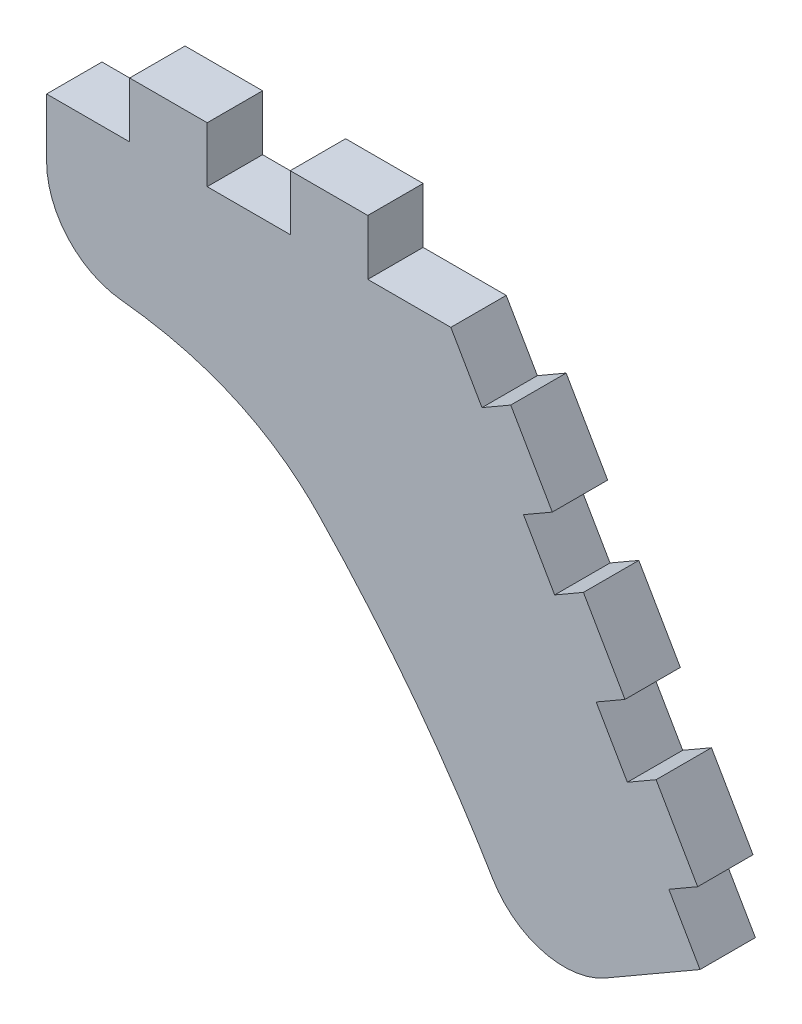
ISO-10303-21;
HEADER;
FILE_DESCRIPTION(('STEP AP214'),'2;1');
FILE_NAME('part.step','',(''),(''),'','','');
FILE_SCHEMA(('AUTOMOTIVE_DESIGN { 1 0 10303 214 1 1 1 1 }'));
ENDSEC;
DATA;
#1=APPLICATION_CONTEXT('core data for automotive mechanical design processes');
#2=APPLICATION_PROTOCOL_DEFINITION('international standard','automotive_design',2000,#1);
#3=PRODUCT_CONTEXT('',#1,'mechanical');
#4=PRODUCT('Part','Part','',(#3));
#5=PRODUCT_RELATED_PRODUCT_CATEGORY('part','',(#4));
#6=PRODUCT_DEFINITION_FORMATION('','',#4);
#7=PRODUCT_DEFINITION_CONTEXT('part definition',#1,'design');
#8=PRODUCT_DEFINITION('design','',#6,#7);
#9=PRODUCT_DEFINITION_SHAPE('','',#8);
#10=(LENGTH_UNIT() NAMED_UNIT(*) SI_UNIT(.MILLI.,.METRE.));
#11=(NAMED_UNIT(*) PLANE_ANGLE_UNIT() SI_UNIT($,.RADIAN.));
#12=(NAMED_UNIT(*) SI_UNIT($,.STERADIAN.) SOLID_ANGLE_UNIT());
#13=UNCERTAINTY_MEASURE_WITH_UNIT(LENGTH_MEASURE(1.E-05),#10,'distance_accuracy_value','');
#14=(GEOMETRIC_REPRESENTATION_CONTEXT(3) GLOBAL_UNCERTAINTY_ASSIGNED_CONTEXT((#13)) GLOBAL_UNIT_ASSIGNED_CONTEXT((#10,
#11,#12)) REPRESENTATION_CONTEXT('',''));
#15=CARTESIAN_POINT('',(0.,0.,0.));
#16=DIRECTION('',(0.,0.,1.));
#17=DIRECTION('',(1.,0.,0.));
#18=AXIS2_PLACEMENT_3D('',#15,#16,#17);
#19=CARTESIAN_POINT('',(0.,0.,10.));
#20=DIRECTION('',(1.,0.,0.));
#21=DIRECTION('',(0.,1.,0.));
#22=AXIS2_PLACEMENT_3D('',#19,#20,#21);
#23=PLANE('',#22);
#24=DIRECTION('',(0.,-1.,0.));
#25=VECTOR('',#24,1.);
#26=CARTESIAN_POINT('',(0.,0.,0.));
#27=LINE('',#26,#25);
#28=CARTESIAN_POINT('',(0.,0.,0.));
#29=VERTEX_POINT('',#28);
#30=CARTESIAN_POINT('',(0.,-10.5712182716982,0.));
#31=VERTEX_POINT('',#30);
#32=EDGE_CURVE('E413',#29,#31,#27,.T.);
#33=ORIENTED_EDGE('',*,*,#32,.T.);
#34=DIRECTION('',(0.,0.,-1.));
#35=VECTOR('',#34,1.);
#36=CARTESIAN_POINT('',(0.,-10.5712182716982,10.));
#37=LINE('',#36,#35);
#38=CARTESIAN_POINT('',(0.,-10.5712182716982,10.));
#39=VERTEX_POINT('',#38);
#40=EDGE_CURVE('E11',#31,#39,#37,.F.);
#41=ORIENTED_EDGE('',*,*,#40,.T.);
#42=DIRECTION('',(0.,-1.,0.));
#43=VECTOR('',#42,1.);
#44=CARTESIAN_POINT('',(0.,0.,10.));
#45=LINE('',#44,#43);
#46=CARTESIAN_POINT('',(0.,0.,10.));
#47=VERTEX_POINT('',#46);
#48=EDGE_CURVE('E224',#47,#39,#45,.T.);
#49=ORIENTED_EDGE('',*,*,#48,.F.);
#50=DIRECTION('',(0.,0.,-1.));
#51=VECTOR('',#50,1.);
#52=CARTESIAN_POINT('',(0.,0.,10.));
#53=LINE('',#52,#51);
#54=EDGE_CURVE('E353',#47,#29,#53,.T.);
#55=ORIENTED_EDGE('',*,*,#54,.T.);
#56=EDGE_LOOP('',(#33,#41,#49,#55));
#57=FACE_BOUND('',#56,.T.);
#58=ADVANCED_FACE('F32',(#57),#23,.F.);
#59=CARTESIAN_POINT('',(0.,-25.,10.));
#60=CARTESIAN_POINT('',(17.2425344672211,-24.6395737065002,10.));
#61=CARTESIAN_POINT('',(35.8999875961201,-27.5043263394054,10.));
#62=CARTESIAN_POINT('',(49.1604769860692,-41.2912650883352,10.));
#63=B_SPLINE_CURVE_WITH_KNOTS('',3,(#59,#60,#61,#62),.UNSPECIFIED.,.F.,.F.,(4,4),(0.,1.),.UNSPECIFIED.);
#64=DIRECTION('',(0.,0.,-1.));
#65=VECTOR('',#64,1.);
#66=SURFACE_OF_LINEAR_EXTRUSION('',#63,#65);
#67=CARTESIAN_POINT('',(13.4616697727823,-25.4921277651584,10.));
#68=VERTEX_POINT('',#67);
#69=CARTESIAN_POINT('',(49.1604769860692,-41.2912650883352,10.));
#70=VERTEX_POINT('',#69);
#71=EDGE_CURVE('E215',#68,#70,#63,.T.);
#72=ORIENTED_EDGE('',*,*,#71,.F.);
#73=DIRECTION('',(0.,0.,-1.));
#74=VECTOR('',#73,1.);
#75=CARTESIAN_POINT('',(13.4616697727821,-25.4921277651583,10.));
#76=LINE('',#75,#74);
#77=CARTESIAN_POINT('',(13.4616697727823,-25.4921277651584,0.));
#78=VERTEX_POINT('',#77);
#79=EDGE_CURVE('E40',#68,#78,#76,.T.);
#80=ORIENTED_EDGE('',*,*,#79,.T.);
#81=CARTESIAN_POINT('',(0.,-25.,0.));
#82=CARTESIAN_POINT('',(17.2425344672211,-24.6395737065002,0.));
#83=CARTESIAN_POINT('',(35.8999875961201,-27.5043263394054,0.));
#84=CARTESIAN_POINT('',(49.1604769860692,-41.2912650883352,0.));
#85=B_SPLINE_CURVE_WITH_KNOTS('',3,(#81,#82,#83,#84),.UNSPECIFIED.,.F.,.F.,(4,4),(0.,1.),.UNSPECIFIED.);
#86=CARTESIAN_POINT('',(49.1604769860692,-41.2912650883352,0.));
#87=VERTEX_POINT('',#86);
#88=EDGE_CURVE('E230',#78,#87,#85,.T.);
#89=ORIENTED_EDGE('',*,*,#88,.T.);
#90=DIRECTION('',(0.,0.,-1.));
#91=VECTOR('',#90,1.);
#92=CARTESIAN_POINT('',(49.1604769860692,-41.2912650883352,10.));
#93=LINE('',#92,#91);
#94=EDGE_CURVE('E227',#70,#87,#93,.T.);
#95=ORIENTED_EDGE('',*,*,#94,.F.);
#96=EDGE_LOOP('',(#72,#80,#89,#95));
#97=FACE_BOUND('',#96,.T.);
#98=ADVANCED_FACE('F228',(#97),#66,.F.);
#99=CARTESIAN_POINT('',(49.1604769860692,-41.2912650883352,10.));
#100=CARTESIAN_POINT('',(64.8173033808277,-57.5696768542521,10.));
#101=CARTESIAN_POINT('',(77.6601813413194,-75.6200172716735,10.));
#102=CARTESIAN_POINT('',(87.6891108675445,-95.4422863405995,10.));
#103=B_SPLINE_CURVE_WITH_KNOTS('',3,(#99,#100,#101,#102),.UNSPECIFIED.,.F.,.F.,(4,4),(0.,1.),.UNSPECIFIED.);
#104=DIRECTION('',(0.,0.,-1.));
#105=VECTOR('',#104,1.);
#106=SURFACE_OF_LINEAR_EXTRUSION('',#103,#105);
#107=CARTESIAN_POINT('',(49.1604769860692,-41.2912650883352,0.));
#108=CARTESIAN_POINT('',(64.8173033808277,-57.5696768542521,0.));
#109=CARTESIAN_POINT('',(77.6601813413194,-75.6200172716735,0.));
#110=CARTESIAN_POINT('',(87.6891108675445,-95.4422863405995,0.));
#111=B_SPLINE_CURVE_WITH_KNOTS('',3,(#107,#108,#109,#110),.UNSPECIFIED.,.F.,.F.,(4,4),(0.,1.),.UNSPECIFIED.);
#112=CARTESIAN_POINT('',(80.5569815722585,-82.440526329078,0.));
#113=VERTEX_POINT('',#112);
#114=EDGE_CURVE('E403',#87,#113,#111,.T.);
#115=ORIENTED_EDGE('',*,*,#114,.T.);
#116=DIRECTION('',(0.,0.,-1.));
#117=VECTOR('',#116,1.);
#118=CARTESIAN_POINT('',(80.5569815722585,-82.440526329078,0.));
#119=LINE('',#118,#117);
#120=CARTESIAN_POINT('',(80.5569815722585,-82.440526329078,10.));
#121=VERTEX_POINT('',#120);
#122=EDGE_CURVE('E239',#113,#121,#119,.F.);
#123=ORIENTED_EDGE('',*,*,#122,.T.);
#124=EDGE_CURVE('E219',#70,#121,#103,.T.);
#125=ORIENTED_EDGE('',*,*,#124,.F.);
#126=ORIENTED_EDGE('',*,*,#94,.T.);
#127=EDGE_LOOP('',(#115,#123,#125,#126));
#128=FACE_BOUND('',#127,.T.);
#129=ADVANCED_FACE('F237',(#128),#106,.F.);
#130=CARTESIAN_POINT('',(118.,-77.9422863405996,10.));
#131=DIRECTION('',(-0.499999999999999,0.866025403784439,0.));
#132=DIRECTION('',(-0.866025403784439,-0.499999999999999,0.));
#133=AXIS2_PLACEMENT_3D('',#130,#131,#132);
#134=PLANE('',#133);
#135=DIRECTION('',(0.866025403784439,0.499999999999999,0.));
#136=VECTOR('',#135,1.);
#137=CARTESIAN_POINT('',(118.,-77.9422863405996,10.));
#138=LINE('',#137,#136);
#139=CARTESIAN_POINT('',(100.959447349708,-87.7806540003853,10.));
#140=VERTEX_POINT('',#139);
#141=CARTESIAN_POINT('',(118.,-77.9422863405996,10.));
#142=VERTEX_POINT('',#141);
#143=EDGE_CURVE('E240',#140,#142,#138,.T.);
#144=ORIENTED_EDGE('',*,*,#143,.F.);
#145=DIRECTION('',(0.,0.,-1.));
#146=VECTOR('',#145,1.);
#147=CARTESIAN_POINT('',(100.959447349708,-87.7806540003853,10.));
#148=LINE('',#147,#146);
#149=CARTESIAN_POINT('',(100.959447349708,-87.7806540003853,0.));
#150=VERTEX_POINT('',#149);
#151=EDGE_CURVE('E234',#140,#150,#148,.T.);
#152=ORIENTED_EDGE('',*,*,#151,.T.);
#153=DIRECTION('',(0.866025403784439,0.499999999999999,0.));
#154=VECTOR('',#153,1.);
#155=CARTESIAN_POINT('',(118.,-77.9422863405996,0.));
#156=LINE('',#155,#154);
#157=CARTESIAN_POINT('',(118.,-77.9422863405996,0.));
#158=VERTEX_POINT('',#157);
#159=EDGE_CURVE('E401',#150,#158,#156,.T.);
#160=ORIENTED_EDGE('',*,*,#159,.T.);
#161=DIRECTION('',(0.,0.,-1.));
#162=VECTOR('',#161,1.);
#163=CARTESIAN_POINT('',(118.,-77.9422863405996,10.));
#164=LINE('',#163,#162);
#165=EDGE_CURVE('E235',#142,#158,#164,.T.);
#166=ORIENTED_EDGE('',*,*,#165,.F.);
#167=EDGE_LOOP('',(#144,#152,#160,#166));
#168=FACE_BOUND('',#167,.T.);
#169=ADVANCED_FACE('F259',(#168),#134,.F.);
#170=CARTESIAN_POINT('',(112.375,-68.1995005480246,10.));
#171=DIRECTION('',(-0.86602540378444,-0.499999999999998,0.));
#172=DIRECTION('',(0.499999999999998,-0.86602540378444,0.));
#173=AXIS2_PLACEMENT_3D('',#170,#171,#172);
#174=PLANE('',#173);
#175=DIRECTION('',(-0.499999999999998,0.86602540378444,0.));
#176=VECTOR('',#175,1.);
#177=CARTESIAN_POINT('',(112.375,-68.1995005480246,0.));
#178=LINE('',#177,#176);
#179=CARTESIAN_POINT('',(112.375,-68.1995005480246,0.));
#180=VERTEX_POINT('',#179);
#181=EDGE_CURVE('E399',#158,#180,#178,.T.);
#182=ORIENTED_EDGE('',*,*,#181,.T.);
#183=DIRECTION('',(0.,0.,-1.));
#184=VECTOR('',#183,1.);
#185=CARTESIAN_POINT('',(112.375,-68.1995005480246,10.));
#186=LINE('',#185,#184);
#187=CARTESIAN_POINT('',(112.375,-68.1995005480246,10.));
#188=VERTEX_POINT('',#187);
#189=EDGE_CURVE('E290',#188,#180,#186,.T.);
#190=ORIENTED_EDGE('',*,*,#189,.F.);
#191=DIRECTION('',(-0.499999999999998,0.86602540378444,0.));
#192=VECTOR('',#191,1.);
#193=CARTESIAN_POINT('',(112.375,-68.1995005480246,10.));
#194=LINE('',#193,#192);
#195=EDGE_CURVE('E242',#142,#188,#194,.T.);
#196=ORIENTED_EDGE('',*,*,#195,.F.);
#197=ORIENTED_EDGE('',*,*,#165,.T.);
#198=EDGE_LOOP('',(#182,#190,#196,#197));
#199=FACE_BOUND('',#198,.T.);
#200=ADVANCED_FACE('F464',(#199),#174,.F.);
#201=CARTESIAN_POINT('',(117.571152422706,-65.1995005480249,10.));
#202=DIRECTION('',(-0.499999999999999,0.866025403784439,0.));
#203=DIRECTION('',(-0.86602540378444,-0.499999999999999,0.));
#204=AXIS2_PLACEMENT_3D('',#201,#202,#203);
#205=PLANE('',#204);
#206=DIRECTION('',(0.866025403784439,0.499999999999999,0.));
#207=VECTOR('',#206,1.);
#208=CARTESIAN_POINT('',(117.571152422706,-65.1995005480249,0.));
#209=LINE('',#208,#207);
#210=CARTESIAN_POINT('',(117.571152422706,-65.1995005480249,0.));
#211=VERTEX_POINT('',#210);
#212=EDGE_CURVE('E397',#180,#211,#209,.T.);
#213=ORIENTED_EDGE('',*,*,#212,.T.);
#214=DIRECTION('',(0.,0.,-1.));
#215=VECTOR('',#214,1.);
#216=CARTESIAN_POINT('',(117.571152422706,-65.1995005480249,10.));
#217=LINE('',#216,#215);
#218=CARTESIAN_POINT('',(117.571152422706,-65.1995005480249,10.));
#219=VERTEX_POINT('',#218);
#220=EDGE_CURVE('E293',#219,#211,#217,.T.);
#221=ORIENTED_EDGE('',*,*,#220,.F.);
#222=DIRECTION('',(0.866025403784439,0.499999999999999,0.));
#223=VECTOR('',#222,1.);
#224=CARTESIAN_POINT('',(117.571152422706,-65.1995005480249,10.));
#225=LINE('',#224,#223);
#226=EDGE_CURVE('E457',#188,#219,#225,.T.);
#227=ORIENTED_EDGE('',*,*,#226,.F.);
#228=ORIENTED_EDGE('',*,*,#189,.T.);
#229=EDGE_LOOP('',(#213,#221,#227,#228));
#230=FACE_BOUND('',#229,.T.);
#231=ADVANCED_FACE('F468',(#230),#205,.F.);
#232=CARTESIAN_POINT('',(110.071152422706,-52.2091194912583,10.));
#233=DIRECTION('',(-0.866025403784439,-0.5,0.));
#234=DIRECTION('',(0.5,-0.866025403784439,0.));
#235=AXIS2_PLACEMENT_3D('',#232,#233,#234);
#236=PLANE('',#235);
#237=DIRECTION('',(-0.5,0.866025403784439,0.));
#238=VECTOR('',#237,1.);
#239=CARTESIAN_POINT('',(110.071152422706,-52.2091194912583,0.));
#240=LINE('',#239,#238);
#241=CARTESIAN_POINT('',(110.071152422706,-52.2091194912583,0.));
#242=VERTEX_POINT('',#241);
#243=EDGE_CURVE('E395',#211,#242,#240,.T.);
#244=ORIENTED_EDGE('',*,*,#243,.T.);
#245=DIRECTION('',(0.,0.,-1.));
#246=VECTOR('',#245,1.);
#247=CARTESIAN_POINT('',(110.071152422706,-52.2091194912583,10.));
#248=LINE('',#247,#246);
#249=CARTESIAN_POINT('',(110.071152422706,-52.2091194912583,10.));
#250=VERTEX_POINT('',#249);
#251=EDGE_CURVE('E296',#250,#242,#248,.T.);
#252=ORIENTED_EDGE('',*,*,#251,.F.);
#253=DIRECTION('',(-0.5,0.866025403784439,0.));
#254=VECTOR('',#253,1.);
#255=CARTESIAN_POINT('',(110.071152422706,-52.2091194912583,10.));
#256=LINE('',#255,#254);
#257=EDGE_CURVE('E455',#219,#250,#256,.T.);
#258=ORIENTED_EDGE('',*,*,#257,.F.);
#259=ORIENTED_EDGE('',*,*,#220,.T.);
#260=EDGE_LOOP('',(#244,#252,#258,#259));
#261=FACE_BOUND('',#260,.T.);
#262=ADVANCED_FACE('F473',(#261),#236,.F.);
#263=CARTESIAN_POINT('',(104.875,-55.209119491258,10.));
#264=DIRECTION('',(0.499999999999999,-0.866025403784439,0.));
#265=DIRECTION('',(0.866025403784439,0.499999999999999,0.));
#266=AXIS2_PLACEMENT_3D('',#263,#264,#265);
#267=PLANE('',#266);
#268=DIRECTION('',(-0.866025403784439,-0.499999999999999,0.));
#269=VECTOR('',#268,1.);
#270=CARTESIAN_POINT('',(104.875,-55.209119491258,0.));
#271=LINE('',#270,#269);
#272=CARTESIAN_POINT('',(104.875,-55.209119491258,0.));
#273=VERTEX_POINT('',#272);
#274=EDGE_CURVE('E393',#242,#273,#271,.T.);
#275=ORIENTED_EDGE('',*,*,#274,.T.);
#276=DIRECTION('',(0.,0.,-1.));
#277=VECTOR('',#276,1.);
#278=CARTESIAN_POINT('',(104.875,-55.209119491258,10.));
#279=LINE('',#278,#277);
#280=CARTESIAN_POINT('',(104.875,-55.209119491258,10.));
#281=VERTEX_POINT('',#280);
#282=EDGE_CURVE('E299',#281,#273,#279,.T.);
#283=ORIENTED_EDGE('',*,*,#282,.F.);
#284=DIRECTION('',(-0.866025403784439,-0.499999999999999,0.));
#285=VECTOR('',#284,1.);
#286=CARTESIAN_POINT('',(104.875,-55.209119491258,10.));
#287=LINE('',#286,#285);
#288=EDGE_CURVE('E453',#250,#281,#287,.T.);
#289=ORIENTED_EDGE('',*,*,#288,.F.);
#290=ORIENTED_EDGE('',*,*,#251,.T.);
#291=EDGE_LOOP('',(#275,#283,#289,#290));
#292=FACE_BOUND('',#291,.T.);
#293=ADVANCED_FACE('F479',(#292),#267,.F.);
#294=CARTESIAN_POINT('',(99.2499999999999,-45.4663336986831,10.));
#295=DIRECTION('',(-0.866025403784439,-0.499999999999999,0.));
#296=DIRECTION('',(0.499999999999999,-0.866025403784439,0.));
#297=AXIS2_PLACEMENT_3D('',#294,#295,#296);
#298=PLANE('',#297);
#299=DIRECTION('',(-0.499999999999999,0.866025403784439,0.));
#300=VECTOR('',#299,1.);
#301=CARTESIAN_POINT('',(99.2499999999999,-45.4663336986831,0.));
#302=LINE('',#301,#300);
#303=CARTESIAN_POINT('',(99.2499999999999,-45.4663336986831,0.));
#304=VERTEX_POINT('',#303);
#305=EDGE_CURVE('E391',#273,#304,#302,.T.);
#306=ORIENTED_EDGE('',*,*,#305,.T.);
#307=DIRECTION('',(0.,0.,-1.));
#308=VECTOR('',#307,1.);
#309=CARTESIAN_POINT('',(99.2499999999999,-45.4663336986831,10.));
#310=LINE('',#309,#308);
#311=CARTESIAN_POINT('',(99.2499999999999,-45.4663336986831,10.));
#312=VERTEX_POINT('',#311);
#313=EDGE_CURVE('E302',#312,#304,#310,.T.);
#314=ORIENTED_EDGE('',*,*,#313,.F.);
#315=DIRECTION('',(-0.499999999999999,0.866025403784439,0.));
#316=VECTOR('',#315,1.);
#317=CARTESIAN_POINT('',(99.2499999999999,-45.4663336986831,10.));
#318=LINE('',#317,#316);
#319=EDGE_CURVE('E451',#281,#312,#318,.T.);
#320=ORIENTED_EDGE('',*,*,#319,.F.);
#321=ORIENTED_EDGE('',*,*,#282,.T.);
#322=EDGE_LOOP('',(#306,#314,#320,#321));
#323=FACE_BOUND('',#322,.T.);
#324=ADVANCED_FACE('F483',(#323),#298,.F.);
#325=CARTESIAN_POINT('',(104.446152422706,-42.4663336986834,10.));
#326=DIRECTION('',(-0.499999999999998,0.86602540378444,0.));
#327=DIRECTION('',(-0.86602540378444,-0.499999999999998,0.));
#328=AXIS2_PLACEMENT_3D('',#325,#326,#327);
#329=PLANE('',#328);
#330=DIRECTION('',(0.86602540378444,0.499999999999998,0.));
#331=VECTOR('',#330,1.);
#332=CARTESIAN_POINT('',(104.446152422706,-42.4663336986834,0.));
#333=LINE('',#332,#331);
#334=CARTESIAN_POINT('',(104.446152422706,-42.4663336986834,0.));
#335=VERTEX_POINT('',#334);
#336=EDGE_CURVE('E389',#304,#335,#333,.T.);
#337=ORIENTED_EDGE('',*,*,#336,.T.);
#338=DIRECTION('',(0.,0.,-1.));
#339=VECTOR('',#338,1.);
#340=CARTESIAN_POINT('',(104.446152422706,-42.4663336986834,10.));
#341=LINE('',#340,#339);
#342=CARTESIAN_POINT('',(104.446152422706,-42.4663336986834,10.));
#343=VERTEX_POINT('',#342);
#344=EDGE_CURVE('E305',#343,#335,#341,.T.);
#345=ORIENTED_EDGE('',*,*,#344,.F.);
#346=DIRECTION('',(0.86602540378444,0.499999999999998,0.));
#347=VECTOR('',#346,1.);
#348=CARTESIAN_POINT('',(104.446152422706,-42.4663336986834,10.));
#349=LINE('',#348,#347);
#350=EDGE_CURVE('E449',#312,#343,#349,.T.);
#351=ORIENTED_EDGE('',*,*,#350,.F.);
#352=ORIENTED_EDGE('',*,*,#313,.T.);
#353=EDGE_LOOP('',(#337,#345,#351,#352));
#354=FACE_BOUND('',#353,.T.);
#355=ADVANCED_FACE('F488',(#354),#329,.F.);
#356=CARTESIAN_POINT('',(96.946152422706,-29.4759526419168,10.));
#357=DIRECTION('',(-0.866025403784439,-0.5,0.));
#358=DIRECTION('',(0.5,-0.866025403784439,0.));
#359=AXIS2_PLACEMENT_3D('',#356,#357,#358);
#360=PLANE('',#359);
#361=DIRECTION('',(-0.5,0.866025403784439,0.));
#362=VECTOR('',#361,1.);
#363=CARTESIAN_POINT('',(96.946152422706,-29.4759526419168,0.));
#364=LINE('',#363,#362);
#365=CARTESIAN_POINT('',(96.946152422706,-29.4759526419168,0.));
#366=VERTEX_POINT('',#365);
#367=EDGE_CURVE('E387',#335,#366,#364,.T.);
#368=ORIENTED_EDGE('',*,*,#367,.T.);
#369=DIRECTION('',(0.,0.,-1.));
#370=VECTOR('',#369,1.);
#371=CARTESIAN_POINT('',(96.946152422706,-29.4759526419168,10.));
#372=LINE('',#371,#370);
#373=CARTESIAN_POINT('',(96.946152422706,-29.4759526419168,10.));
#374=VERTEX_POINT('',#373);
#375=EDGE_CURVE('E308',#374,#366,#372,.T.);
#376=ORIENTED_EDGE('',*,*,#375,.F.);
#377=DIRECTION('',(-0.5,0.866025403784439,0.));
#378=VECTOR('',#377,1.);
#379=CARTESIAN_POINT('',(96.946152422706,-29.4759526419168,10.));
#380=LINE('',#379,#378);
#381=EDGE_CURVE('E447',#343,#374,#380,.T.);
#382=ORIENTED_EDGE('',*,*,#381,.F.);
#383=ORIENTED_EDGE('',*,*,#344,.T.);
#384=EDGE_LOOP('',(#368,#376,#382,#383));
#385=FACE_BOUND('',#384,.T.);
#386=ADVANCED_FACE('F494',(#385),#360,.F.);
#387=CARTESIAN_POINT('',(91.7499999999999,-32.4759526419165,10.));
#388=DIRECTION('',(0.499999999999998,-0.866025403784439,0.));
#389=DIRECTION('',(0.86602540378444,0.499999999999998,0.));
#390=AXIS2_PLACEMENT_3D('',#387,#388,#389);
#391=PLANE('',#390);
#392=DIRECTION('',(-0.866025403784439,-0.499999999999998,0.));
#393=VECTOR('',#392,1.);
#394=CARTESIAN_POINT('',(91.7499999999999,-32.4759526419165,0.));
#395=LINE('',#394,#393);
#396=CARTESIAN_POINT('',(91.7499999999999,-32.4759526419165,0.));
#397=VERTEX_POINT('',#396);
#398=EDGE_CURVE('E385',#366,#397,#395,.T.);
#399=ORIENTED_EDGE('',*,*,#398,.T.);
#400=DIRECTION('',(0.,0.,-1.));
#401=VECTOR('',#400,1.);
#402=CARTESIAN_POINT('',(91.7499999999999,-32.4759526419165,10.));
#403=LINE('',#402,#401);
#404=CARTESIAN_POINT('',(91.7499999999999,-32.4759526419165,10.));
#405=VERTEX_POINT('',#404);
#406=EDGE_CURVE('E311',#405,#397,#403,.T.);
#407=ORIENTED_EDGE('',*,*,#406,.F.);
#408=DIRECTION('',(-0.866025403784439,-0.499999999999998,0.));
#409=VECTOR('',#408,1.);
#410=CARTESIAN_POINT('',(91.7499999999999,-32.4759526419165,10.));
#411=LINE('',#410,#409);
#412=EDGE_CURVE('E445',#374,#405,#411,.T.);
#413=ORIENTED_EDGE('',*,*,#412,.F.);
#414=ORIENTED_EDGE('',*,*,#375,.T.);
#415=EDGE_LOOP('',(#399,#407,#413,#414));
#416=FACE_BOUND('',#415,.T.);
#417=ADVANCED_FACE('F498',(#416),#391,.F.);
#418=CARTESIAN_POINT('',(86.125,-22.7331668493415,10.));
#419=DIRECTION('',(-0.866025403784439,-0.5,0.));
#420=DIRECTION('',(0.5,-0.866025403784439,0.));
#421=AXIS2_PLACEMENT_3D('',#418,#419,#420);
#422=PLANE('',#421);
#423=DIRECTION('',(-0.499999999999999,0.866025403784439,0.));
#424=VECTOR('',#423,1.);
#425=CARTESIAN_POINT('',(86.125,-22.7331668493415,0.));
#426=LINE('',#425,#424);
#427=CARTESIAN_POINT('',(86.125,-22.7331668493415,0.));
#428=VERTEX_POINT('',#427);
#429=EDGE_CURVE('E383',#397,#428,#426,.T.);
#430=ORIENTED_EDGE('',*,*,#429,.T.);
#431=DIRECTION('',(0.,0.,-1.));
#432=VECTOR('',#431,1.);
#433=CARTESIAN_POINT('',(86.125,-22.7331668493415,10.));
#434=LINE('',#433,#432);
#435=CARTESIAN_POINT('',(86.125,-22.7331668493415,10.));
#436=VERTEX_POINT('',#435);
#437=EDGE_CURVE('E314',#436,#428,#434,.T.);
#438=ORIENTED_EDGE('',*,*,#437,.F.);
#439=DIRECTION('',(-0.499999999999999,0.866025403784439,0.));
#440=VECTOR('',#439,1.);
#441=CARTESIAN_POINT('',(86.125,-22.7331668493415,10.));
#442=LINE('',#441,#440);
#443=EDGE_CURVE('E443',#405,#436,#442,.T.);
#444=ORIENTED_EDGE('',*,*,#443,.F.);
#445=ORIENTED_EDGE('',*,*,#406,.T.);
#446=EDGE_LOOP('',(#430,#438,#444,#445));
#447=FACE_BOUND('',#446,.T.);
#448=ADVANCED_FACE('F503',(#447),#422,.F.);
#449=CARTESIAN_POINT('',(91.321152422706,-19.7331668493419,10.));
#450=DIRECTION('',(-0.5,0.866025403784439,0.));
#451=DIRECTION('',(-0.866025403784439,-0.5,0.));
#452=AXIS2_PLACEMENT_3D('',#449,#450,#451);
#453=PLANE('',#452);
#454=DIRECTION('',(0.866025403784439,0.5,0.));
#455=VECTOR('',#454,1.);
#456=CARTESIAN_POINT('',(91.321152422706,-19.7331668493419,0.));
#457=LINE('',#456,#455);
#458=CARTESIAN_POINT('',(91.321152422706,-19.7331668493419,0.));
#459=VERTEX_POINT('',#458);
#460=EDGE_CURVE('E381',#428,#459,#457,.T.);
#461=ORIENTED_EDGE('',*,*,#460,.T.);
#462=DIRECTION('',(0.,0.,-1.));
#463=VECTOR('',#462,1.);
#464=CARTESIAN_POINT('',(91.321152422706,-19.7331668493419,10.));
#465=LINE('',#464,#463);
#466=CARTESIAN_POINT('',(91.321152422706,-19.7331668493419,10.));
#467=VERTEX_POINT('',#466);
#468=EDGE_CURVE('E317',#467,#459,#465,.T.);
#469=ORIENTED_EDGE('',*,*,#468,.F.);
#470=DIRECTION('',(0.866025403784439,0.5,0.));
#471=VECTOR('',#470,1.);
#472=CARTESIAN_POINT('',(91.321152422706,-19.7331668493419,10.));
#473=LINE('',#472,#471);
#474=EDGE_CURVE('E441',#436,#467,#473,.T.);
#475=ORIENTED_EDGE('',*,*,#474,.F.);
#476=ORIENTED_EDGE('',*,*,#437,.T.);
#477=EDGE_LOOP('',(#461,#469,#475,#476));
#478=FACE_BOUND('',#477,.T.);
#479=ADVANCED_FACE('F509',(#478),#453,.F.);
#480=CARTESIAN_POINT('',(83.821152422706,-6.74278579257528,10.));
#481=DIRECTION('',(-0.86602540378444,-0.499999999999998,0.));
#482=DIRECTION('',(0.499999999999998,-0.86602540378444,0.));
#483=AXIS2_PLACEMENT_3D('',#480,#481,#482);
#484=PLANE('',#483);
#485=DIRECTION('',(-0.499999999999998,0.86602540378444,0.));
#486=VECTOR('',#485,1.);
#487=CARTESIAN_POINT('',(83.821152422706,-6.74278579257528,0.));
#488=LINE('',#487,#486);
#489=CARTESIAN_POINT('',(83.821152422706,-6.74278579257528,0.));
#490=VERTEX_POINT('',#489);
#491=EDGE_CURVE('E379',#459,#490,#488,.T.);
#492=ORIENTED_EDGE('',*,*,#491,.T.);
#493=DIRECTION('',(0.,0.,-1.));
#494=VECTOR('',#493,1.);
#495=CARTESIAN_POINT('',(83.821152422706,-6.74278579257528,10.));
#496=LINE('',#495,#494);
#497=CARTESIAN_POINT('',(83.821152422706,-6.74278579257528,10.));
#498=VERTEX_POINT('',#497);
#499=EDGE_CURVE('E320',#498,#490,#496,.T.);
#500=ORIENTED_EDGE('',*,*,#499,.F.);
#501=DIRECTION('',(-0.499999999999998,0.86602540378444,0.));
#502=VECTOR('',#501,1.);
#503=CARTESIAN_POINT('',(83.821152422706,-6.74278579257528,10.));
#504=LINE('',#503,#502);
#505=EDGE_CURVE('E439',#467,#498,#504,.T.);
#506=ORIENTED_EDGE('',*,*,#505,.F.);
#507=ORIENTED_EDGE('',*,*,#468,.T.);
#508=EDGE_LOOP('',(#492,#500,#506,#507));
#509=FACE_BOUND('',#508,.T.);
#510=ADVANCED_FACE('F513',(#509),#484,.F.);
#511=CARTESIAN_POINT('',(78.625,-9.74278579257494,10.));
#512=DIRECTION('',(0.499999999999999,-0.866025403784439,0.));
#513=DIRECTION('',(0.866025403784439,0.499999999999999,0.));
#514=AXIS2_PLACEMENT_3D('',#511,#512,#513);
#515=PLANE('',#514);
#516=DIRECTION('',(-0.866025403784439,-0.499999999999999,0.));
#517=VECTOR('',#516,1.);
#518=CARTESIAN_POINT('',(78.625,-9.74278579257494,0.));
#519=LINE('',#518,#517);
#520=CARTESIAN_POINT('',(78.625,-9.74278579257494,0.));
#521=VERTEX_POINT('',#520);
#522=EDGE_CURVE('E377',#490,#521,#519,.T.);
#523=ORIENTED_EDGE('',*,*,#522,.T.);
#524=DIRECTION('',(0.,0.,-1.));
#525=VECTOR('',#524,1.);
#526=CARTESIAN_POINT('',(78.625,-9.74278579257494,10.));
#527=LINE('',#526,#525);
#528=CARTESIAN_POINT('',(78.625,-9.74278579257494,10.));
#529=VERTEX_POINT('',#528);
#530=EDGE_CURVE('E323',#529,#521,#527,.T.);
#531=ORIENTED_EDGE('',*,*,#530,.F.);
#532=DIRECTION('',(-0.866025403784439,-0.499999999999999,0.));
#533=VECTOR('',#532,1.);
#534=CARTESIAN_POINT('',(78.625,-9.74278579257494,10.));
#535=LINE('',#534,#533);
#536=EDGE_CURVE('E437',#498,#529,#535,.T.);
#537=ORIENTED_EDGE('',*,*,#536,.F.);
#538=ORIENTED_EDGE('',*,*,#499,.T.);
#539=EDGE_LOOP('',(#523,#531,#537,#538));
#540=FACE_BOUND('',#539,.T.);
#541=ADVANCED_FACE('F518',(#540),#515,.F.);
#542=CARTESIAN_POINT('',(73.,0.,10.));
#543=DIRECTION('',(-0.866025403784439,-0.499999999999999,0.));
#544=DIRECTION('',(0.499999999999999,-0.866025403784439,0.));
#545=AXIS2_PLACEMENT_3D('',#542,#543,#544);
#546=PLANE('',#545);
#547=DIRECTION('',(-0.499999999999999,0.866025403784439,0.));
#548=VECTOR('',#547,1.);
#549=CARTESIAN_POINT('',(73.,0.,0.));
#550=LINE('',#549,#548);
#551=CARTESIAN_POINT('',(73.,0.,0.));
#552=VERTEX_POINT('',#551);
#553=EDGE_CURVE('E375',#521,#552,#550,.T.);
#554=ORIENTED_EDGE('',*,*,#553,.T.);
#555=DIRECTION('',(0.,0.,-1.));
#556=VECTOR('',#555,1.);
#557=CARTESIAN_POINT('',(73.,0.,10.));
#558=LINE('',#557,#556);
#559=CARTESIAN_POINT('',(73.,0.,10.));
#560=VERTEX_POINT('',#559);
#561=EDGE_CURVE('E326',#560,#552,#558,.T.);
#562=ORIENTED_EDGE('',*,*,#561,.F.);
#563=DIRECTION('',(-0.499999999999999,0.866025403784439,0.));
#564=VECTOR('',#563,1.);
#565=CARTESIAN_POINT('',(73.,0.,10.));
#566=LINE('',#565,#564);
#567=EDGE_CURVE('E435',#529,#560,#566,.T.);
#568=ORIENTED_EDGE('',*,*,#567,.F.);
#569=ORIENTED_EDGE('',*,*,#530,.T.);
#570=EDGE_LOOP('',(#554,#562,#568,#569));
#571=FACE_BOUND('',#570,.T.);
#572=ADVANCED_FACE('F524',(#571),#546,.F.);
#573=CARTESIAN_POINT('',(58.,0.,10.));
#574=DIRECTION('',(0.,-1.,0.));
#575=DIRECTION('',(0.,0.,-1.));
#576=AXIS2_PLACEMENT_3D('',#573,#574,#575);
#577=PLANE('',#576);
#578=DIRECTION('',(-1.,0.,0.));
#579=VECTOR('',#578,1.);
#580=CARTESIAN_POINT('',(58.,0.,0.));
#581=LINE('',#580,#579);
#582=CARTESIAN_POINT('',(58.,0.,0.));
#583=VERTEX_POINT('',#582);
#584=EDGE_CURVE('E373',#552,#583,#581,.T.);
#585=ORIENTED_EDGE('',*,*,#584,.T.);
#586=DIRECTION('',(0.,0.,-1.));
#587=VECTOR('',#586,1.);
#588=CARTESIAN_POINT('',(58.,0.,10.));
#589=LINE('',#588,#587);
#590=CARTESIAN_POINT('',(58.,0.,10.));
#591=VERTEX_POINT('',#590);
#592=EDGE_CURVE('E329',#591,#583,#589,.T.);
#593=ORIENTED_EDGE('',*,*,#592,.F.);
#594=DIRECTION('',(-1.,0.,0.));
#595=VECTOR('',#594,1.);
#596=CARTESIAN_POINT('',(58.,0.,10.));
#597=LINE('',#596,#595);
#598=EDGE_CURVE('E433',#560,#591,#597,.T.);
#599=ORIENTED_EDGE('',*,*,#598,.F.);
#600=ORIENTED_EDGE('',*,*,#561,.T.);
#601=EDGE_LOOP('',(#585,#593,#599,#600));
#602=FACE_BOUND('',#601,.T.);
#603=ADVANCED_FACE('F528',(#602),#577,.F.);
#604=CARTESIAN_POINT('',(58.,10.,10.));
#605=DIRECTION('',(-1.,0.,0.));
#606=DIRECTION('',(0.,0.,1.));
#607=AXIS2_PLACEMENT_3D('',#604,#605,#606);
#608=PLANE('',#607);
#609=DIRECTION('',(0.,1.,0.));
#610=VECTOR('',#609,1.);
#611=CARTESIAN_POINT('',(58.,10.,0.));
#612=LINE('',#611,#610);
#613=CARTESIAN_POINT('',(58.,10.,0.));
#614=VERTEX_POINT('',#613);
#615=EDGE_CURVE('E371',#583,#614,#612,.T.);
#616=ORIENTED_EDGE('',*,*,#615,.T.);
#617=DIRECTION('',(0.,0.,-1.));
#618=VECTOR('',#617,1.);
#619=CARTESIAN_POINT('',(58.,10.,10.));
#620=LINE('',#619,#618);
#621=CARTESIAN_POINT('',(58.,10.,10.));
#622=VERTEX_POINT('',#621);
#623=EDGE_CURVE('E332',#622,#614,#620,.T.);
#624=ORIENTED_EDGE('',*,*,#623,.F.);
#625=DIRECTION('',(0.,1.,0.));
#626=VECTOR('',#625,1.);
#627=CARTESIAN_POINT('',(58.,10.,10.));
#628=LINE('',#627,#626);
#629=EDGE_CURVE('E431',#591,#622,#628,.T.);
#630=ORIENTED_EDGE('',*,*,#629,.F.);
#631=ORIENTED_EDGE('',*,*,#592,.T.);
#632=EDGE_LOOP('',(#616,#624,#630,#631));
#633=FACE_BOUND('',#632,.T.);
#634=ADVANCED_FACE('F533',(#633),#608,.F.);
#635=CARTESIAN_POINT('',(44.,10.,10.));
#636=DIRECTION('',(0.,-1.,0.));
#637=DIRECTION('',(0.,0.,-1.));
#638=AXIS2_PLACEMENT_3D('',#635,#636,#637);
#639=PLANE('',#638);
#640=DIRECTION('',(-1.,0.,0.));
#641=VECTOR('',#640,1.);
#642=CARTESIAN_POINT('',(44.,10.,0.));
#643=LINE('',#642,#641);
#644=CARTESIAN_POINT('',(44.,10.,0.));
#645=VERTEX_POINT('',#644);
#646=EDGE_CURVE('E369',#614,#645,#643,.T.);
#647=ORIENTED_EDGE('',*,*,#646,.T.);
#648=DIRECTION('',(0.,0.,-1.));
#649=VECTOR('',#648,1.);
#650=CARTESIAN_POINT('',(44.,10.,10.));
#651=LINE('',#650,#649);
#652=CARTESIAN_POINT('',(44.,10.,10.));
#653=VERTEX_POINT('',#652);
#654=EDGE_CURVE('E335',#653,#645,#651,.T.);
#655=ORIENTED_EDGE('',*,*,#654,.F.);
#656=DIRECTION('',(-1.,0.,0.));
#657=VECTOR('',#656,1.);
#658=CARTESIAN_POINT('',(44.,10.,10.));
#659=LINE('',#658,#657);
#660=EDGE_CURVE('E429',#622,#653,#659,.T.);
#661=ORIENTED_EDGE('',*,*,#660,.F.);
#662=ORIENTED_EDGE('',*,*,#623,.T.);
#663=EDGE_LOOP('',(#647,#655,#661,#662));
#664=FACE_BOUND('',#663,.T.);
#665=ADVANCED_FACE('F539',(#664),#639,.F.);
#666=CARTESIAN_POINT('',(44.,0.,10.));
#667=DIRECTION('',(1.,0.,0.));
#668=DIRECTION('',(0.,0.,-1.));
#669=AXIS2_PLACEMENT_3D('',#666,#667,#668);
#670=PLANE('',#669);
#671=DIRECTION('',(0.,-1.,0.));
#672=VECTOR('',#671,1.);
#673=CARTESIAN_POINT('',(44.,0.,0.));
#674=LINE('',#673,#672);
#675=CARTESIAN_POINT('',(44.,0.,0.));
#676=VERTEX_POINT('',#675);
#677=EDGE_CURVE('E367',#645,#676,#674,.T.);
#678=ORIENTED_EDGE('',*,*,#677,.T.);
#679=DIRECTION('',(0.,0.,-1.));
#680=VECTOR('',#679,1.);
#681=CARTESIAN_POINT('',(44.,0.,10.));
#682=LINE('',#681,#680);
#683=CARTESIAN_POINT('',(44.,0.,10.));
#684=VERTEX_POINT('',#683);
#685=EDGE_CURVE('E338',#684,#676,#682,.T.);
#686=ORIENTED_EDGE('',*,*,#685,.F.);
#687=DIRECTION('',(0.,-1.,0.));
#688=VECTOR('',#687,1.);
#689=CARTESIAN_POINT('',(44.,0.,10.));
#690=LINE('',#689,#688);
#691=EDGE_CURVE('E427',#653,#684,#690,.T.);
#692=ORIENTED_EDGE('',*,*,#691,.F.);
#693=ORIENTED_EDGE('',*,*,#654,.T.);
#694=EDGE_LOOP('',(#678,#686,#692,#693));
#695=FACE_BOUND('',#694,.T.);
#696=ADVANCED_FACE('F543',(#695),#670,.F.);
#697=CARTESIAN_POINT('',(29.,0.,10.));
#698=DIRECTION('',(0.,-1.,0.));
#699=DIRECTION('',(0.,0.,-1.));
#700=AXIS2_PLACEMENT_3D('',#697,#698,#699);
#701=PLANE('',#700);
#702=DIRECTION('',(-1.,0.,0.));
#703=VECTOR('',#702,1.);
#704=CARTESIAN_POINT('',(29.,0.,0.));
#705=LINE('',#704,#703);
#706=CARTESIAN_POINT('',(29.,0.,0.));
#707=VERTEX_POINT('',#706);
#708=EDGE_CURVE('E365',#676,#707,#705,.T.);
#709=ORIENTED_EDGE('',*,*,#708,.T.);
#710=DIRECTION('',(0.,0.,-1.));
#711=VECTOR('',#710,1.);
#712=CARTESIAN_POINT('',(29.,0.,10.));
#713=LINE('',#712,#711);
#714=CARTESIAN_POINT('',(29.,0.,10.));
#715=VERTEX_POINT('',#714);
#716=EDGE_CURVE('E341',#715,#707,#713,.T.);
#717=ORIENTED_EDGE('',*,*,#716,.F.);
#718=DIRECTION('',(-1.,0.,0.));
#719=VECTOR('',#718,1.);
#720=CARTESIAN_POINT('',(29.,0.,10.));
#721=LINE('',#720,#719);
#722=EDGE_CURVE('E425',#684,#715,#721,.T.);
#723=ORIENTED_EDGE('',*,*,#722,.F.);
#724=ORIENTED_EDGE('',*,*,#685,.T.);
#725=EDGE_LOOP('',(#709,#717,#723,#724));
#726=FACE_BOUND('',#725,.T.);
#727=ADVANCED_FACE('F548',(#726),#701,.F.);
#728=CARTESIAN_POINT('',(29.,10.,10.));
#729=DIRECTION('',(-1.,0.,0.));
#730=DIRECTION('',(0.,0.,1.));
#731=AXIS2_PLACEMENT_3D('',#728,#729,#730);
#732=PLANE('',#731);
#733=DIRECTION('',(0.,1.,0.));
#734=VECTOR('',#733,1.);
#735=CARTESIAN_POINT('',(29.,10.,0.));
#736=LINE('',#735,#734);
#737=CARTESIAN_POINT('',(29.,10.,0.));
#738=VERTEX_POINT('',#737);
#739=EDGE_CURVE('E363',#707,#738,#736,.T.);
#740=ORIENTED_EDGE('',*,*,#739,.T.);
#741=DIRECTION('',(0.,0.,-1.));
#742=VECTOR('',#741,1.);
#743=CARTESIAN_POINT('',(29.,10.,10.));
#744=LINE('',#743,#742);
#745=CARTESIAN_POINT('',(29.,10.,10.));
#746=VERTEX_POINT('',#745);
#747=EDGE_CURVE('E344',#746,#738,#744,.T.);
#748=ORIENTED_EDGE('',*,*,#747,.F.);
#749=DIRECTION('',(0.,1.,0.));
#750=VECTOR('',#749,1.);
#751=CARTESIAN_POINT('',(29.,10.,10.));
#752=LINE('',#751,#750);
#753=EDGE_CURVE('E423',#715,#746,#752,.T.);
#754=ORIENTED_EDGE('',*,*,#753,.F.);
#755=ORIENTED_EDGE('',*,*,#716,.T.);
#756=EDGE_LOOP('',(#740,#748,#754,#755));
#757=FACE_BOUND('',#756,.T.);
#758=ADVANCED_FACE('F554',(#757),#732,.F.);
#759=CARTESIAN_POINT('',(15.,10.,10.));
#760=DIRECTION('',(0.,-1.,0.));
#761=DIRECTION('',(0.,0.,-1.));
#762=AXIS2_PLACEMENT_3D('',#759,#760,#761);
#763=PLANE('',#762);
#764=DIRECTION('',(-1.,0.,0.));
#765=VECTOR('',#764,1.);
#766=CARTESIAN_POINT('',(15.,10.,0.));
#767=LINE('',#766,#765);
#768=CARTESIAN_POINT('',(15.,10.,0.));
#769=VERTEX_POINT('',#768);
#770=EDGE_CURVE('E361',#738,#769,#767,.T.);
#771=ORIENTED_EDGE('',*,*,#770,.T.);
#772=DIRECTION('',(0.,0.,-1.));
#773=VECTOR('',#772,1.);
#774=CARTESIAN_POINT('',(15.,10.,10.));
#775=LINE('',#774,#773);
#776=CARTESIAN_POINT('',(15.,10.,10.));
#777=VERTEX_POINT('',#776);
#778=EDGE_CURVE('E347',#777,#769,#775,.T.);
#779=ORIENTED_EDGE('',*,*,#778,.F.);
#780=DIRECTION('',(-1.,0.,0.));
#781=VECTOR('',#780,1.);
#782=CARTESIAN_POINT('',(15.,10.,10.));
#783=LINE('',#782,#781);
#784=EDGE_CURVE('E421',#746,#777,#783,.T.);
#785=ORIENTED_EDGE('',*,*,#784,.F.);
#786=ORIENTED_EDGE('',*,*,#747,.T.);
#787=EDGE_LOOP('',(#771,#779,#785,#786));
#788=FACE_BOUND('',#787,.T.);
#789=ADVANCED_FACE('F558',(#788),#763,.F.);
#790=CARTESIAN_POINT('',(15.,0.,10.));
#791=DIRECTION('',(1.,0.,0.));
#792=DIRECTION('',(0.,1.,0.));
#793=AXIS2_PLACEMENT_3D('',#790,#791,#792);
#794=PLANE('',#793);
#795=DIRECTION('',(0.,-1.,0.));
#796=VECTOR('',#795,1.);
#797=CARTESIAN_POINT('',(15.,0.,0.));
#798=LINE('',#797,#796);
#799=CARTESIAN_POINT('',(15.,0.,0.));
#800=VERTEX_POINT('',#799);
#801=EDGE_CURVE('E359',#769,#800,#798,.T.);
#802=ORIENTED_EDGE('',*,*,#801,.T.);
#803=DIRECTION('',(0.,0.,-1.));
#804=VECTOR('',#803,1.);
#805=CARTESIAN_POINT('',(15.,0.,10.));
#806=LINE('',#805,#804);
#807=CARTESIAN_POINT('',(15.,0.,10.));
#808=VERTEX_POINT('',#807);
#809=EDGE_CURVE('E350',#808,#800,#806,.T.);
#810=ORIENTED_EDGE('',*,*,#809,.F.);
#811=DIRECTION('',(0.,-1.,0.));
#812=VECTOR('',#811,1.);
#813=CARTESIAN_POINT('',(15.,0.,10.));
#814=LINE('',#813,#812);
#815=EDGE_CURVE('E419',#777,#808,#814,.T.);
#816=ORIENTED_EDGE('',*,*,#815,.F.);
#817=ORIENTED_EDGE('',*,*,#778,.T.);
#818=EDGE_LOOP('',(#802,#810,#816,#817));
#819=FACE_BOUND('',#818,.T.);
#820=ADVANCED_FACE('F563',(#819),#794,.F.);
#821=CARTESIAN_POINT('',(0.,0.,10.));
#822=DIRECTION('',(0.,-1.,0.));
#823=DIRECTION('',(0.,0.,-1.));
#824=AXIS2_PLACEMENT_3D('',#821,#822,#823);
#825=PLANE('',#824);
#826=DIRECTION('',(-1.,0.,0.));
#827=VECTOR('',#826,1.);
#828=CARTESIAN_POINT('',(0.,0.,0.));
#829=LINE('',#828,#827);
#830=EDGE_CURVE('E357',#800,#29,#829,.T.);
#831=ORIENTED_EDGE('',*,*,#830,.T.);
#832=ORIENTED_EDGE('',*,*,#54,.F.);
#833=DIRECTION('',(-1.,0.,0.));
#834=VECTOR('',#833,1.);
#835=CARTESIAN_POINT('',(0.,0.,10.));
#836=LINE('',#835,#834);
#837=EDGE_CURVE('E356',#808,#47,#836,.T.);
#838=ORIENTED_EDGE('',*,*,#837,.F.);
#839=ORIENTED_EDGE('',*,*,#809,.T.);
#840=EDGE_LOOP('',(#831,#832,#838,#839));
#841=FACE_BOUND('',#840,.T.);
#842=ADVANCED_FACE('F567',(#841),#825,.F.);
#843=CARTESIAN_POINT('',(26.0735053970116,-27.8403706532565,10.));
#844=DIRECTION('',(0.,0.,1.));
#845=DIRECTION('',(1.,0.,0.));
#846=AXIS2_PLACEMENT_3D('',#843,#844,#845);
#847=PLANE('',#846);
#848=ORIENTED_EDGE('',*,*,#124,.T.);
#849=CARTESIAN_POINT('',(93.4594473497085,-74.7902729436187,10.));
#850=DIRECTION('',(0.,0.,1.));
#851=DIRECTION('',(1.,0.,0.));
#852=AXIS2_PLACEMENT_3D('',#849,#850,#851);
#853=CIRCLE('',#852,15.);
#854=EDGE_CURVE('E276',#121,#140,#853,.T.);
#855=ORIENTED_EDGE('',*,*,#854,.T.);
#856=ORIENTED_EDGE('',*,*,#143,.T.);
#857=ORIENTED_EDGE('',*,*,#195,.T.);
#858=ORIENTED_EDGE('',*,*,#226,.T.);
#859=ORIENTED_EDGE('',*,*,#257,.T.);
#860=ORIENTED_EDGE('',*,*,#288,.T.);
#861=ORIENTED_EDGE('',*,*,#319,.T.);
#862=ORIENTED_EDGE('',*,*,#350,.T.);
#863=ORIENTED_EDGE('',*,*,#381,.T.);
#864=ORIENTED_EDGE('',*,*,#412,.T.);
#865=ORIENTED_EDGE('',*,*,#443,.T.);
#866=ORIENTED_EDGE('',*,*,#474,.T.);
#867=ORIENTED_EDGE('',*,*,#505,.T.);
#868=ORIENTED_EDGE('',*,*,#536,.T.);
#869=ORIENTED_EDGE('',*,*,#567,.T.);
#870=ORIENTED_EDGE('',*,*,#598,.T.);
#871=ORIENTED_EDGE('',*,*,#629,.T.);
#872=ORIENTED_EDGE('',*,*,#660,.T.);
#873=ORIENTED_EDGE('',*,*,#691,.T.);
#874=ORIENTED_EDGE('',*,*,#722,.T.);
#875=ORIENTED_EDGE('',*,*,#753,.T.);
#876=ORIENTED_EDGE('',*,*,#784,.T.);
#877=ORIENTED_EDGE('',*,*,#815,.T.);
#878=ORIENTED_EDGE('',*,*,#837,.T.);
#879=ORIENTED_EDGE('',*,*,#48,.T.);
#880=CARTESIAN_POINT('',(15.,-10.5712182716982,10.));
#881=DIRECTION('',(0.,0.,1.));
#882=DIRECTION('',(1.,0.,0.));
#883=AXIS2_PLACEMENT_3D('',#880,#881,#882);
#884=CIRCLE('',#883,15.);
#885=EDGE_CURVE('E47',#39,#68,#884,.T.);
#886=ORIENTED_EDGE('',*,*,#885,.T.);
#887=ORIENTED_EDGE('',*,*,#71,.T.);
#888=EDGE_LOOP('',(#848,#855,#856,#857,#858,#859,#860,#861,#862,#863,#864,#865,#866,#867,#868,
#869,#870,#871,#872,#873,#874,#875,#876,#877,#878,#879,#886,#887));
#889=FACE_BOUND('',#888,.T.);
#890=ADVANCED_FACE('F217',(#889),#847,.T.);
#891=CARTESIAN_POINT('',(26.0735053970116,-27.8403706532565,0.));
#892=DIRECTION('',(0.,0.,1.));
#893=DIRECTION('',(1.,0.,0.));
#894=AXIS2_PLACEMENT_3D('',#891,#892,#893);
#895=PLANE('',#894);
#896=ORIENTED_EDGE('',*,*,#159,.F.);
#897=CARTESIAN_POINT('',(93.4594473497085,-74.7902729436187,0.));
#898=DIRECTION('',(0.,0.,1.));
#899=DIRECTION('',(1.,0.,0.));
#900=AXIS2_PLACEMENT_3D('',#897,#898,#899);
#901=CIRCLE('',#900,15.);
#902=EDGE_CURVE('E283',#150,#113,#901,.F.);
#903=ORIENTED_EDGE('',*,*,#902,.T.);
#904=ORIENTED_EDGE('',*,*,#114,.F.);
#905=ORIENTED_EDGE('',*,*,#88,.F.);
#906=CARTESIAN_POINT('',(15.,-10.5712182716982,0.));
#907=DIRECTION('',(0.,0.,1.));
#908=DIRECTION('',(1.,0.,0.));
#909=AXIS2_PLACEMENT_3D('',#906,#907,#908);
#910=CIRCLE('',#909,15.);
#911=EDGE_CURVE('E285',#78,#31,#910,.F.);
#912=ORIENTED_EDGE('',*,*,#911,.T.);
#913=ORIENTED_EDGE('',*,*,#32,.F.);
#914=ORIENTED_EDGE('',*,*,#830,.F.);
#915=ORIENTED_EDGE('',*,*,#801,.F.);
#916=ORIENTED_EDGE('',*,*,#770,.F.);
#917=ORIENTED_EDGE('',*,*,#739,.F.);
#918=ORIENTED_EDGE('',*,*,#708,.F.);
#919=ORIENTED_EDGE('',*,*,#677,.F.);
#920=ORIENTED_EDGE('',*,*,#646,.F.);
#921=ORIENTED_EDGE('',*,*,#615,.F.);
#922=ORIENTED_EDGE('',*,*,#584,.F.);
#923=ORIENTED_EDGE('',*,*,#553,.F.);
#924=ORIENTED_EDGE('',*,*,#522,.F.);
#925=ORIENTED_EDGE('',*,*,#491,.F.);
#926=ORIENTED_EDGE('',*,*,#460,.F.);
#927=ORIENTED_EDGE('',*,*,#429,.F.);
#928=ORIENTED_EDGE('',*,*,#398,.F.);
#929=ORIENTED_EDGE('',*,*,#367,.F.);
#930=ORIENTED_EDGE('',*,*,#336,.F.);
#931=ORIENTED_EDGE('',*,*,#305,.F.);
#932=ORIENTED_EDGE('',*,*,#274,.F.);
#933=ORIENTED_EDGE('',*,*,#243,.F.);
#934=ORIENTED_EDGE('',*,*,#212,.F.);
#935=ORIENTED_EDGE('',*,*,#181,.F.);
#936=EDGE_LOOP('',(#896,#903,#904,#905,#912,#913,#914,#915,#916,#917,#918,#919,#920,#921,#922,
#923,#924,#925,#926,#927,#928,#929,#930,#931,#932,#933,#934,#935));
#937=FACE_BOUND('',#936,.T.);
#938=ADVANCED_FACE('F266',(#937),#895,.F.);
#939=CARTESIAN_POINT('',(93.4594473497085,-74.7902729436187,5.));
#940=DIRECTION('',(0.,0.,-1.));
#941=DIRECTION('',(-1.,0.,0.));
#942=AXIS2_PLACEMENT_3D('',#939,#940,#941);
#943=CYLINDRICAL_SURFACE('',#942,15.);
#944=ORIENTED_EDGE('',*,*,#854,.F.);
#945=ORIENTED_EDGE('',*,*,#122,.F.);
#946=ORIENTED_EDGE('',*,*,#902,.F.);
#947=ORIENTED_EDGE('',*,*,#151,.F.);
#948=EDGE_LOOP('',(#944,#945,#946,#947));
#949=FACE_BOUND('',#948,.T.);
#950=ADVANCED_FACE('F264',(#949),#943,.T.);
#951=CARTESIAN_POINT('',(15.,-10.5712182716982,5.));
#952=DIRECTION('',(0.,0.,-1.));
#953=DIRECTION('',(-1.,0.,0.));
#954=AXIS2_PLACEMENT_3D('',#951,#952,#953);
#955=CYLINDRICAL_SURFACE('',#954,15.);
#956=ORIENTED_EDGE('',*,*,#885,.F.);
#957=ORIENTED_EDGE('',*,*,#40,.F.);
#958=ORIENTED_EDGE('',*,*,#911,.F.);
#959=ORIENTED_EDGE('',*,*,#79,.F.);
#960=EDGE_LOOP('',(#956,#957,#958,#959));
#961=FACE_BOUND('',#960,.T.);
#962=ADVANCED_FACE('F34',(#961),#955,.T.);
#963=CLOSED_SHELL('',(#58,#98,#129,#169,#200,#231,#262,#293,#324,#355,#386,#417,#448,#479,#510,
#541,#572,#603,#634,#665,#696,#727,#758,#789,#820,#842,#890,#938,#950,#962));
#964=MANIFOLD_SOLID_BREP('B2',#963);
#965=ADVANCED_BREP_SHAPE_REPRESENTATION('',(#18,#964),#14);
#966=SHAPE_DEFINITION_REPRESENTATION(#9,#965);
ENDSEC;
END-ISO-10303-21;
